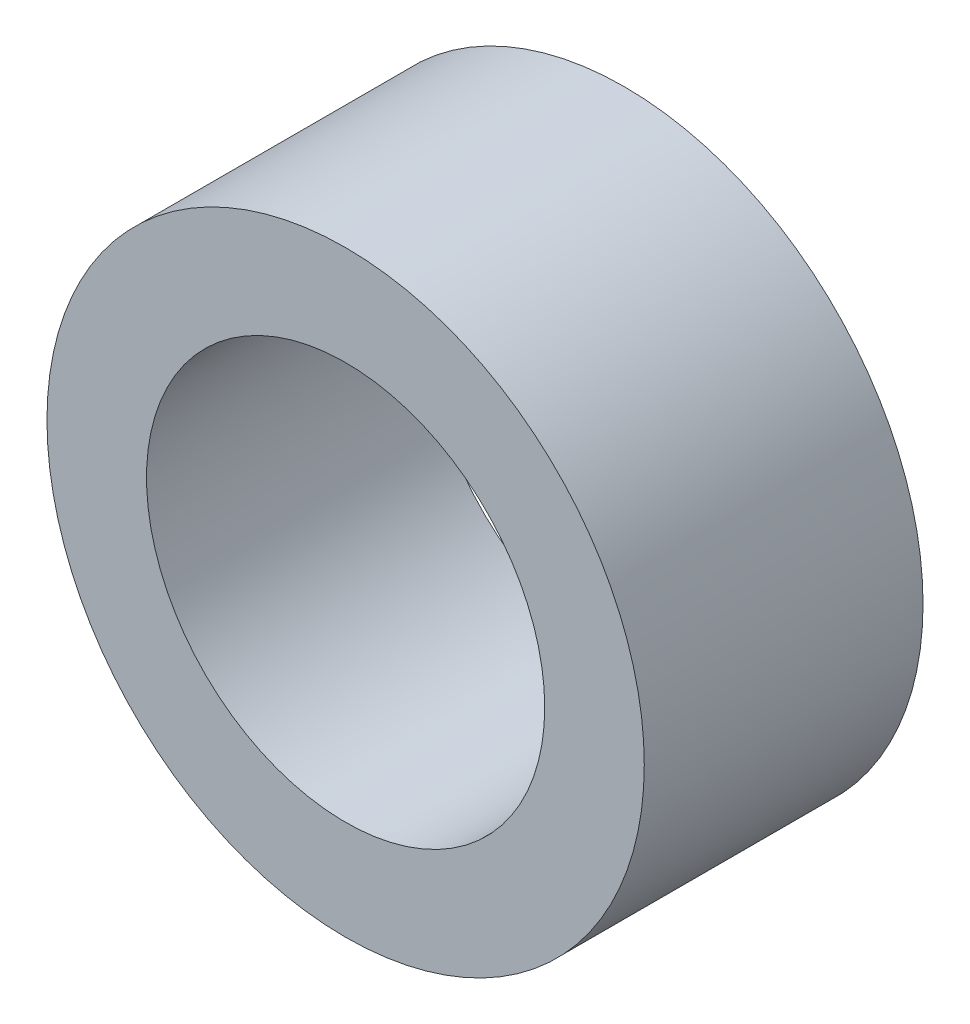
ISO-10303-21;
HEADER;
FILE_DESCRIPTION(('STEP AP214'),'2;1');
FILE_NAME('part.step','',(''),(''),'','','');
FILE_SCHEMA(('AUTOMOTIVE_DESIGN { 1 0 10303 214 1 1 1 1 }'));
ENDSEC;
DATA;
#1=APPLICATION_CONTEXT('core data for automotive mechanical design processes');
#2=APPLICATION_PROTOCOL_DEFINITION('international standard','automotive_design',2000,#1);
#3=PRODUCT_CONTEXT('',#1,'mechanical');
#4=PRODUCT('Part','Part','',(#3));
#5=PRODUCT_RELATED_PRODUCT_CATEGORY('part','',(#4));
#6=PRODUCT_DEFINITION_FORMATION('','',#4);
#7=PRODUCT_DEFINITION_CONTEXT('part definition',#1,'design');
#8=PRODUCT_DEFINITION('design','',#6,#7);
#9=PRODUCT_DEFINITION_SHAPE('','',#8);
#10=(LENGTH_UNIT() NAMED_UNIT(*) SI_UNIT(.MILLI.,.METRE.));
#11=(NAMED_UNIT(*) PLANE_ANGLE_UNIT() SI_UNIT($,.RADIAN.));
#12=(NAMED_UNIT(*) SI_UNIT($,.STERADIAN.) SOLID_ANGLE_UNIT());
#13=UNCERTAINTY_MEASURE_WITH_UNIT(LENGTH_MEASURE(1.E-05),#10,'distance_accuracy_value','');
#14=(GEOMETRIC_REPRESENTATION_CONTEXT(3) GLOBAL_UNCERTAINTY_ASSIGNED_CONTEXT((#13)) GLOBAL_UNIT_ASSIGNED_CONTEXT((#10,
#11,#12)) REPRESENTATION_CONTEXT('',''));
#15=CARTESIAN_POINT('',(0.,0.,0.));
#16=DIRECTION('',(0.,0.,1.));
#17=DIRECTION('',(1.,0.,0.));
#18=AXIS2_PLACEMENT_3D('',#15,#16,#17);
#19=CARTESIAN_POINT('',(0.,0.,14.));
#20=DIRECTION('',(0.,0.,1.));
#21=DIRECTION('',(1.,0.,0.));
#22=AXIS2_PLACEMENT_3D('',#19,#20,#21);
#23=PLANE('',#22);
#24=CARTESIAN_POINT('',(0.,0.,14.));
#25=DIRECTION('',(0.,0.,1.));
#26=DIRECTION('',(1.,0.,0.));
#27=AXIS2_PLACEMENT_3D('',#24,#25,#26);
#28=CIRCLE('',#27,30.);
#29=CARTESIAN_POINT('',(30.,0.,14.));
#30=VERTEX_POINT('',#29);
#31=EDGE_CURVE('E10',#30,#30,#28,.T.);
#32=ORIENTED_EDGE('',*,*,#31,.T.);
#33=EDGE_LOOP('',(#32));
#34=FACE_BOUND('',#33,.T.);
#35=CARTESIAN_POINT('',(0.,0.,14.));
#36=DIRECTION('',(0.,0.,1.));
#37=DIRECTION('',(1.,0.,0.));
#38=AXIS2_PLACEMENT_3D('',#35,#36,#37);
#39=CIRCLE('',#38,20.);
#40=CARTESIAN_POINT('',(20.,0.,14.));
#41=VERTEX_POINT('',#40);
#42=EDGE_CURVE('E42',#41,#41,#39,.T.);
#43=ORIENTED_EDGE('',*,*,#42,.F.);
#44=EDGE_LOOP('',(#43));
#45=FACE_BOUND('',#44,.T.);
#46=ADVANCED_FACE('F31',(#34,#45),#23,.T.);
#47=CARTESIAN_POINT('',(0.,0.,-14.));
#48=DIRECTION('',(0.,0.,1.));
#49=DIRECTION('',(1.,0.,0.));
#50=AXIS2_PLACEMENT_3D('',#47,#48,#49);
#51=PLANE('',#50);
#52=CARTESIAN_POINT('',(0.,0.,-14.));
#53=DIRECTION('',(0.,0.,1.));
#54=DIRECTION('',(1.,0.,0.));
#55=AXIS2_PLACEMENT_3D('',#52,#53,#54);
#56=CIRCLE('',#55,30.);
#57=CARTESIAN_POINT('',(30.,0.,-14.));
#58=VERTEX_POINT('',#57);
#59=EDGE_CURVE('E35',#58,#58,#56,.T.);
#60=ORIENTED_EDGE('',*,*,#59,.F.);
#61=EDGE_LOOP('',(#60));
#62=FACE_BOUND('',#61,.T.);
#63=CARTESIAN_POINT('',(0.,0.,-14.));
#64=DIRECTION('',(0.,0.,1.));
#65=DIRECTION('',(1.,0.,0.));
#66=AXIS2_PLACEMENT_3D('',#63,#64,#65);
#67=CIRCLE('',#66,20.);
#68=CARTESIAN_POINT('',(20.,0.,-14.));
#69=VERTEX_POINT('',#68);
#70=EDGE_CURVE('E44',#69,#69,#67,.T.);
#71=ORIENTED_EDGE('',*,*,#70,.T.);
#72=EDGE_LOOP('',(#71));
#73=FACE_BOUND('',#72,.T.);
#74=ADVANCED_FACE('F54',(#62,#73),#51,.F.);
#75=CARTESIAN_POINT('',(0.,0.,14.));
#76=DIRECTION('',(0.,0.,-1.));
#77=DIRECTION('',(-1.,0.,0.));
#78=AXIS2_PLACEMENT_3D('',#75,#76,#77);
#79=CYLINDRICAL_SURFACE('',#78,30.);
#80=ORIENTED_EDGE('',*,*,#31,.F.);
#81=EDGE_LOOP('',(#80));
#82=FACE_BOUND('',#81,.T.);
#83=ORIENTED_EDGE('',*,*,#59,.T.);
#84=EDGE_LOOP('',(#83));
#85=FACE_BOUND('',#84,.T.);
#86=ADVANCED_FACE('F33',(#82,#85),#79,.T.);
#87=CARTESIAN_POINT('',(0.,0.,14.));
#88=DIRECTION('',(0.,0.,-1.));
#89=DIRECTION('',(-1.,0.,0.));
#90=AXIS2_PLACEMENT_3D('',#87,#88,#89);
#91=CYLINDRICAL_SURFACE('',#90,20.);
#92=ORIENTED_EDGE('',*,*,#42,.T.);
#93=EDGE_LOOP('',(#92));
#94=FACE_BOUND('',#93,.T.);
#95=ORIENTED_EDGE('',*,*,#70,.F.);
#96=EDGE_LOOP('',(#95));
#97=FACE_BOUND('',#96,.T.);
#98=ADVANCED_FACE('F50',(#94,#97),#91,.F.);
#99=CLOSED_SHELL('',(#46,#74,#86,#98));
#100=MANIFOLD_SOLID_BREP('B2',#99);
#101=ADVANCED_BREP_SHAPE_REPRESENTATION('',(#18,#100),#14);
#102=SHAPE_DEFINITION_REPRESENTATION(#9,#101);
ENDSEC;
END-ISO-10303-21;
